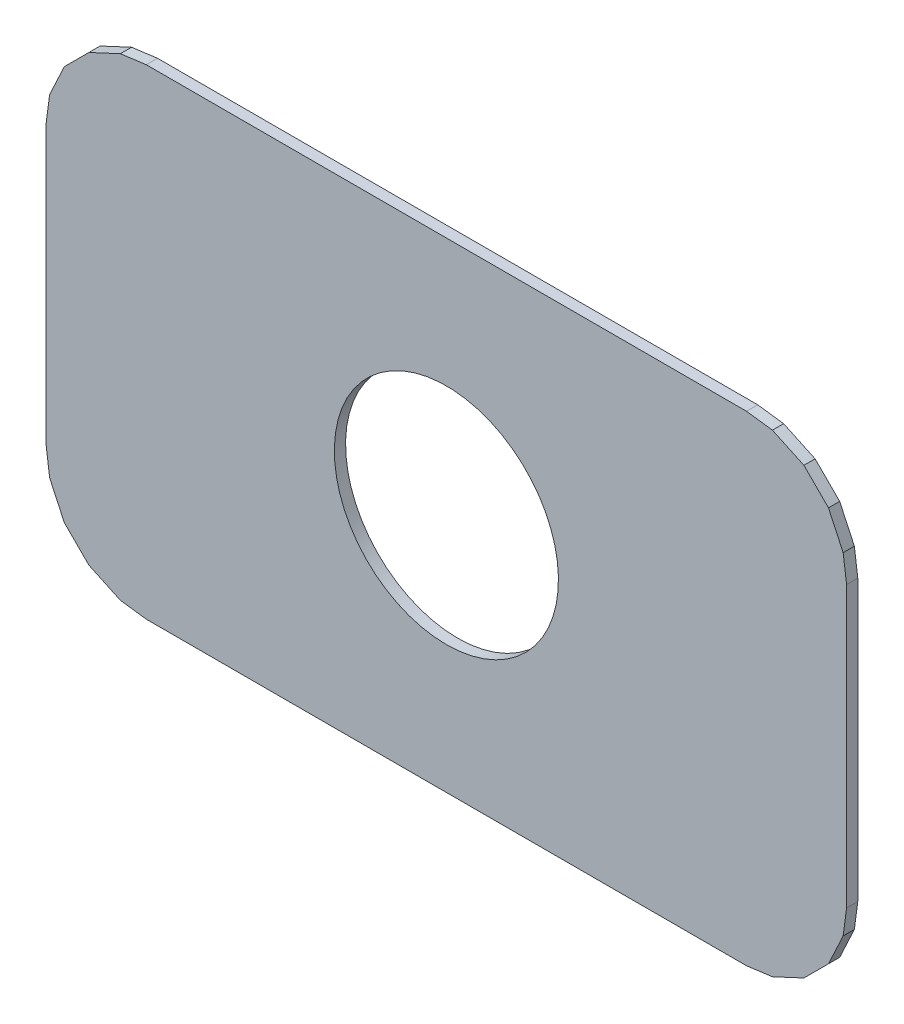
ISO-10303-21;
HEADER;
FILE_DESCRIPTION(('STEP AP214'),'2;1');
FILE_NAME('part.step','',(''),(''),'','','');
FILE_SCHEMA(('AUTOMOTIVE_DESIGN { 1 0 10303 214 1 1 1 1 }'));
ENDSEC;
DATA;
#1=APPLICATION_CONTEXT('core data for automotive mechanical design processes');
#2=APPLICATION_PROTOCOL_DEFINITION('international standard','automotive_design',2000,#1);
#3=PRODUCT_CONTEXT('',#1,'mechanical');
#4=PRODUCT('Part','Part','',(#3));
#5=PRODUCT_RELATED_PRODUCT_CATEGORY('part','',(#4));
#6=PRODUCT_DEFINITION_FORMATION('','',#4);
#7=PRODUCT_DEFINITION_CONTEXT('part definition',#1,'design');
#8=PRODUCT_DEFINITION('design','',#6,#7);
#9=PRODUCT_DEFINITION_SHAPE('','',#8);
#10=(LENGTH_UNIT() NAMED_UNIT(*) SI_UNIT(.MILLI.,.METRE.));
#11=(NAMED_UNIT(*) PLANE_ANGLE_UNIT() SI_UNIT($,.RADIAN.));
#12=(NAMED_UNIT(*) SI_UNIT($,.STERADIAN.) SOLID_ANGLE_UNIT());
#13=UNCERTAINTY_MEASURE_WITH_UNIT(LENGTH_MEASURE(1.E-05),#10,'distance_accuracy_value','');
#14=(GEOMETRIC_REPRESENTATION_CONTEXT(3) GLOBAL_UNCERTAINTY_ASSIGNED_CONTEXT((#13)) GLOBAL_UNIT_ASSIGNED_CONTEXT((#10,
#11,#12)) REPRESENTATION_CONTEXT('',''));
#15=CARTESIAN_POINT('',(0.,0.,0.));
#16=DIRECTION('',(0.,0.,1.));
#17=DIRECTION('',(1.,0.,0.));
#18=AXIS2_PLACEMENT_3D('',#15,#16,#17);
#19=CARTESIAN_POINT('',(115.401,-115.808,-0.045));
#20=DIRECTION('',(0.,0.,-1.));
#21=DIRECTION('',(0.,-1.,0.));
#22=AXIS2_PLACEMENT_3D('',#19,#20,#21);
#23=CYLINDRICAL_SURFACE('',#22,0.35);
#24=CARTESIAN_POINT('',(115.401,-115.808,-0.035));
#25=DIRECTION('',(0.,0.,-1.));
#26=DIRECTION('',(0.,-1.,0.));
#27=AXIS2_PLACEMENT_3D('',#24,#25,#26);
#28=CIRCLE('',#27,0.35);
#29=CARTESIAN_POINT('',(115.401,-116.158,-0.035));
#30=VERTEX_POINT('',#29);
#31=EDGE_CURVE('E370',#30,#30,#28,.T.);
#32=ORIENTED_EDGE('',*,*,#31,.T.);
#33=DIRECTION('',(0.,0.,1.));
#34=VECTOR('',#33,1.);
#35=CARTESIAN_POINT('',(115.401,-116.158,-0.045));
#36=LINE('',#35,#34);
#37=CARTESIAN_POINT('',(115.401,-116.158,0.));
#38=VERTEX_POINT('',#37);
#39=EDGE_CURVE('E11',#30,#38,#36,.T.);
#40=ORIENTED_EDGE('',*,*,#39,.T.);
#41=CARTESIAN_POINT('',(115.401,-115.808,0.));
#42=DIRECTION('',(0.,0.,-1.));
#43=DIRECTION('',(0.,-1.,0.));
#44=AXIS2_PLACEMENT_3D('',#41,#42,#43);
#45=CIRCLE('',#44,0.35);
#46=EDGE_CURVE('E432',#38,#38,#45,.T.);
#47=ORIENTED_EDGE('',*,*,#46,.F.);
#48=ORIENTED_EDGE('',*,*,#39,.F.);
#49=EDGE_LOOP('',(#32,#40,#47,#48));
#50=FACE_BOUND('',#49,.T.);
#51=ADVANCED_FACE('F17',(#50),#23,.F.);
#52=CARTESIAN_POINT('',(114.382619,-116.547352,-0.035));
#53=DIRECTION('',(-0.422618610856986,-0.90630762424097,0.));
#54=DIRECTION('',(-0.90630762424097,0.422618610856986,0.));
#55=AXIS2_PLACEMENT_3D('',#52,#53,#54);
#56=PLANE('',#55);
#57=DIRECTION('',(0.,0.,1.));
#58=VECTOR('',#57,1.);
#59=CARTESIAN_POINT('',(114.382619,-116.547352,-0.035));
#60=LINE('',#59,#58);
#61=CARTESIAN_POINT('',(114.382619,-116.547352,-0.035));
#62=VERTEX_POINT('',#61);
#63=CARTESIAN_POINT('',(114.382619,-116.547352,0.));
#64=VERTEX_POINT('',#63);
#65=EDGE_CURVE('E25',#62,#64,#60,.T.);
#66=ORIENTED_EDGE('',*,*,#65,.T.);
#67=DIRECTION('',(-0.90630762424097,0.422618610856986,0.));
#68=VECTOR('',#67,1.);
#69=CARTESIAN_POINT('',(114.382619,-116.547352,0.));
#70=LINE('',#69,#68);
#71=CARTESIAN_POINT('',(114.284257,-116.501485,0.));
#72=VERTEX_POINT('',#71);
#73=EDGE_CURVE('E414',#64,#72,#70,.T.);
#74=ORIENTED_EDGE('',*,*,#73,.T.);
#75=DIRECTION('',(0.,0.,1.));
#76=VECTOR('',#75,1.);
#77=CARTESIAN_POINT('',(114.284257,-116.501485,-0.035));
#78=LINE('',#77,#76);
#79=CARTESIAN_POINT('',(114.284257,-116.501485,-0.035));
#80=VERTEX_POINT('',#79);
#81=EDGE_CURVE('E278',#80,#72,#78,.T.);
#82=ORIENTED_EDGE('',*,*,#81,.F.);
#83=DIRECTION('',(-0.90630762424097,0.422618610856986,0.));
#84=VECTOR('',#83,1.);
#85=CARTESIAN_POINT('',(114.382619,-116.547352,-0.035));
#86=LINE('',#85,#84);
#87=EDGE_CURVE('E308',#62,#80,#86,.T.);
#88=ORIENTED_EDGE('',*,*,#87,.F.);
#89=EDGE_LOOP('',(#66,#74,#82,#88));
#90=FACE_BOUND('',#89,.T.);
#91=ADVANCED_FACE('F462',(#90),#56,.T.);
#92=CARTESIAN_POINT('',(114.4635,-116.558,-0.035));
#93=DIRECTION('',(-0.130523955190962,-0.99144515588171,0.));
#94=DIRECTION('',(-0.99144515588171,0.130523955190962,0.));
#95=AXIS2_PLACEMENT_3D('',#92,#93,#94);
#96=PLANE('',#95);
#97=DIRECTION('',(0.,0.,1.));
#98=VECTOR('',#97,1.);
#99=CARTESIAN_POINT('',(114.4635,-116.558,-0.035));
#100=LINE('',#99,#98);
#101=CARTESIAN_POINT('',(114.4635,-116.558,-0.035));
#102=VERTEX_POINT('',#101);
#103=CARTESIAN_POINT('',(114.4635,-116.558,0.));
#104=VERTEX_POINT('',#103);
#105=EDGE_CURVE('E275',#102,#104,#100,.T.);
#106=ORIENTED_EDGE('',*,*,#105,.T.);
#107=DIRECTION('',(-0.99144515588171,0.130523955190962,0.));
#108=VECTOR('',#107,1.);
#109=CARTESIAN_POINT('',(114.4635,-116.558,0.));
#110=LINE('',#109,#108);
#111=EDGE_CURVE('E418',#104,#64,#110,.T.);
#112=ORIENTED_EDGE('',*,*,#111,.T.);
#113=ORIENTED_EDGE('',*,*,#65,.F.);
#114=DIRECTION('',(-0.99144515588171,0.130523955190962,0.));
#115=VECTOR('',#114,1.);
#116=CARTESIAN_POINT('',(114.4635,-116.558,-0.035));
#117=LINE('',#116,#115);
#118=EDGE_CURVE('E304',#102,#62,#117,.T.);
#119=ORIENTED_EDGE('',*,*,#118,.F.);
#120=EDGE_LOOP('',(#106,#112,#113,#119));
#121=FACE_BOUND('',#120,.T.);
#122=ADVANCED_FACE('F477',(#121),#96,.T.);
#123=CARTESIAN_POINT('',(114.284257,-116.501485,-0.035));
#124=DIRECTION('',(-0.707106781186548,-0.707106781186548,0.));
#125=DIRECTION('',(-0.707106781186548,0.707106781186548,0.));
#126=AXIS2_PLACEMENT_3D('',#123,#124,#125);
#127=PLANE('',#126);
#128=ORIENTED_EDGE('',*,*,#81,.T.);
#129=DIRECTION('',(-0.707106781186548,0.707106781186548,0.));
#130=VECTOR('',#129,1.);
#131=CARTESIAN_POINT('',(114.284257,-116.501485,0.));
#132=LINE('',#131,#130);
#133=CARTESIAN_POINT('',(114.207515,-116.424743,0.));
#134=VERTEX_POINT('',#133);
#135=EDGE_CURVE('E410',#72,#134,#132,.T.);
#136=ORIENTED_EDGE('',*,*,#135,.T.);
#137=DIRECTION('',(0.,0.,1.));
#138=VECTOR('',#137,1.);
#139=CARTESIAN_POINT('',(114.207515,-116.424743,-0.035));
#140=LINE('',#139,#138);
#141=CARTESIAN_POINT('',(114.207515,-116.424743,-0.035));
#142=VERTEX_POINT('',#141);
#143=EDGE_CURVE('E279',#142,#134,#140,.T.);
#144=ORIENTED_EDGE('',*,*,#143,.F.);
#145=DIRECTION('',(-0.707106781186548,0.707106781186548,0.));
#146=VECTOR('',#145,1.);
#147=CARTESIAN_POINT('',(114.284257,-116.501485,-0.035));
#148=LINE('',#147,#146);
#149=EDGE_CURVE('E320',#80,#142,#148,.T.);
#150=ORIENTED_EDGE('',*,*,#149,.F.);
#151=EDGE_LOOP('',(#128,#136,#144,#150));
#152=FACE_BOUND('',#151,.T.);
#153=ADVANCED_FACE('F456',(#152),#127,.T.);
#154=CARTESIAN_POINT('',(116.3385,-116.558,-0.035));
#155=DIRECTION('',(0.,-1.,0.));
#156=DIRECTION('',(0.,0.,-1.));
#157=AXIS2_PLACEMENT_3D('',#154,#155,#156);
#158=PLANE('',#157);
#159=DIRECTION('',(0.,0.,1.));
#160=VECTOR('',#159,1.);
#161=CARTESIAN_POINT('',(116.3385,-116.558,-0.035));
#162=LINE('',#161,#160);
#163=CARTESIAN_POINT('',(116.3385,-116.558,-0.035));
#164=VERTEX_POINT('',#163);
#165=CARTESIAN_POINT('',(116.3385,-116.558,0.));
#166=VERTEX_POINT('',#165);
#167=EDGE_CURVE('E323',#164,#166,#162,.T.);
#168=ORIENTED_EDGE('',*,*,#167,.T.);
#169=DIRECTION('',(-1.,0.,0.));
#170=VECTOR('',#169,1.);
#171=CARTESIAN_POINT('',(116.3385,-116.558,0.));
#172=LINE('',#171,#170);
#173=EDGE_CURVE('E339',#166,#104,#172,.T.);
#174=ORIENTED_EDGE('',*,*,#173,.T.);
#175=ORIENTED_EDGE('',*,*,#105,.F.);
#176=DIRECTION('',(-1.,0.,0.));
#177=VECTOR('',#176,1.);
#178=CARTESIAN_POINT('',(116.3385,-116.558,-0.035));
#179=LINE('',#178,#177);
#180=EDGE_CURVE('E303',#164,#102,#179,.T.);
#181=ORIENTED_EDGE('',*,*,#180,.F.);
#182=EDGE_LOOP('',(#168,#174,#175,#181));
#183=FACE_BOUND('',#182,.T.);
#184=ADVANCED_FACE('F550',(#183),#158,.T.);
#185=CARTESIAN_POINT('',(114.207515,-116.424743,-0.035));
#186=DIRECTION('',(-0.90630762424097,-0.422618610856986,0.));
#187=DIRECTION('',(-0.422618610856986,0.90630762424097,0.));
#188=AXIS2_PLACEMENT_3D('',#185,#186,#187);
#189=PLANE('',#188);
#190=ORIENTED_EDGE('',*,*,#143,.T.);
#191=DIRECTION('',(-0.422618610856986,0.90630762424097,0.));
#192=VECTOR('',#191,1.);
#193=CARTESIAN_POINT('',(114.207515,-116.424743,0.));
#194=LINE('',#193,#192);
#195=CARTESIAN_POINT('',(114.161648,-116.326381,0.));
#196=VERTEX_POINT('',#195);
#197=EDGE_CURVE('E404',#134,#196,#194,.T.);
#198=ORIENTED_EDGE('',*,*,#197,.T.);
#199=DIRECTION('',(0.,0.,1.));
#200=VECTOR('',#199,1.);
#201=CARTESIAN_POINT('',(114.161648,-116.326381,-0.035));
#202=LINE('',#201,#200);
#203=CARTESIAN_POINT('',(114.161648,-116.326381,-0.035));
#204=VERTEX_POINT('',#203);
#205=EDGE_CURVE('E383',#204,#196,#202,.T.);
#206=ORIENTED_EDGE('',*,*,#205,.F.);
#207=DIRECTION('',(-0.422618610856986,0.90630762424097,0.));
#208=VECTOR('',#207,1.);
#209=CARTESIAN_POINT('',(114.207515,-116.424743,-0.035));
#210=LINE('',#209,#208);
#211=EDGE_CURVE('E327',#142,#204,#210,.T.);
#212=ORIENTED_EDGE('',*,*,#211,.F.);
#213=EDGE_LOOP('',(#190,#198,#206,#212));
#214=FACE_BOUND('',#213,.T.);
#215=ADVANCED_FACE('F470',(#214),#189,.T.);
#216=CARTESIAN_POINT('',(116.419381,-116.547352,-0.035));
#217=DIRECTION('',(0.130523955190962,-0.99144515588171,0.));
#218=DIRECTION('',(0.,0.,-1.));
#219=AXIS2_PLACEMENT_3D('',#216,#217,#218);
#220=PLANE('',#219);
#221=DIRECTION('',(0.,0.,1.));
#222=VECTOR('',#221,1.);
#223=CARTESIAN_POINT('',(116.419381,-116.547352,-0.035));
#224=LINE('',#223,#222);
#225=CARTESIAN_POINT('',(116.419381,-116.547352,-0.035));
#226=VERTEX_POINT('',#225);
#227=CARTESIAN_POINT('',(116.419381,-116.547352,0.));
#228=VERTEX_POINT('',#227);
#229=EDGE_CURVE('E450',#226,#228,#224,.T.);
#230=ORIENTED_EDGE('',*,*,#229,.T.);
#231=DIRECTION('',(-0.99144515588171,-0.130523955190962,0.));
#232=VECTOR('',#231,1.);
#233=CARTESIAN_POINT('',(116.419381,-116.547352,0.));
#234=LINE('',#233,#232);
#235=EDGE_CURVE('E334',#228,#166,#234,.T.);
#236=ORIENTED_EDGE('',*,*,#235,.T.);
#237=ORIENTED_EDGE('',*,*,#167,.F.);
#238=DIRECTION('',(-0.99144515588171,-0.130523955190962,0.));
#239=VECTOR('',#238,1.);
#240=CARTESIAN_POINT('',(116.419381,-116.547352,-0.035));
#241=LINE('',#240,#239);
#242=EDGE_CURVE('E298',#226,#164,#241,.T.);
#243=ORIENTED_EDGE('',*,*,#242,.F.);
#244=EDGE_LOOP('',(#230,#236,#237,#243));
#245=FACE_BOUND('',#244,.T.);
#246=ADVANCED_FACE('F549',(#245),#220,.T.);
#247=CARTESIAN_POINT('',(114.161648,-116.326381,-0.035));
#248=DIRECTION('',(-0.99144515588171,-0.130523955190962,0.));
#249=DIRECTION('',(-0.130523955190962,0.99144515588171,0.));
#250=AXIS2_PLACEMENT_3D('',#247,#248,#249);
#251=PLANE('',#250);
#252=ORIENTED_EDGE('',*,*,#205,.T.);
#253=DIRECTION('',(-0.130523955190962,0.99144515588171,0.));
#254=VECTOR('',#253,1.);
#255=CARTESIAN_POINT('',(114.161648,-116.326381,0.));
#256=LINE('',#255,#254);
#257=CARTESIAN_POINT('',(114.151,-116.2455,0.));
#258=VERTEX_POINT('',#257);
#259=EDGE_CURVE('E400',#196,#258,#256,.T.);
#260=ORIENTED_EDGE('',*,*,#259,.T.);
#261=DIRECTION('',(0.,0.,1.));
#262=VECTOR('',#261,1.);
#263=CARTESIAN_POINT('',(114.151,-116.2455,-0.035));
#264=LINE('',#263,#262);
#265=CARTESIAN_POINT('',(114.151,-116.2455,-0.035));
#266=VERTEX_POINT('',#265);
#267=EDGE_CURVE('E448',#266,#258,#264,.T.);
#268=ORIENTED_EDGE('',*,*,#267,.F.);
#269=DIRECTION('',(-0.130523955190962,0.99144515588171,0.));
#270=VECTOR('',#269,1.);
#271=CARTESIAN_POINT('',(114.161648,-116.326381,-0.035));
#272=LINE('',#271,#270);
#273=EDGE_CURVE('E331',#204,#266,#272,.T.);
#274=ORIENTED_EDGE('',*,*,#273,.F.);
#275=EDGE_LOOP('',(#252,#260,#268,#274));
#276=FACE_BOUND('',#275,.T.);
#277=ADVANCED_FACE('F657',(#276),#251,.T.);
#278=CARTESIAN_POINT('',(116.517743,-116.501485,-0.035));
#279=DIRECTION('',(0.422618610856986,-0.90630762424097,0.));
#280=DIRECTION('',(0.,0.,-1.));
#281=AXIS2_PLACEMENT_3D('',#278,#279,#280);
#282=PLANE('',#281);
#283=DIRECTION('',(0.,0.,1.));
#284=VECTOR('',#283,1.);
#285=CARTESIAN_POINT('',(116.517743,-116.501485,-0.035));
#286=LINE('',#285,#284);
#287=CARTESIAN_POINT('',(116.517743,-116.501485,-0.035));
#288=VERTEX_POINT('',#287);
#289=CARTESIAN_POINT('',(116.517743,-116.501485,0.));
#290=VERTEX_POINT('',#289);
#291=EDGE_CURVE('E447',#288,#290,#286,.T.);
#292=ORIENTED_EDGE('',*,*,#291,.T.);
#293=DIRECTION('',(-0.90630762424097,-0.422618610856986,0.));
#294=VECTOR('',#293,1.);
#295=CARTESIAN_POINT('',(116.517743,-116.501485,0.));
#296=LINE('',#295,#294);
#297=EDGE_CURVE('E338',#290,#228,#296,.T.);
#298=ORIENTED_EDGE('',*,*,#297,.T.);
#299=ORIENTED_EDGE('',*,*,#229,.F.);
#300=DIRECTION('',(-0.90630762424097,-0.422618610856986,0.));
#301=VECTOR('',#300,1.);
#302=CARTESIAN_POINT('',(116.517743,-116.501485,-0.035));
#303=LINE('',#302,#301);
#304=EDGE_CURVE('E294',#288,#226,#303,.T.);
#305=ORIENTED_EDGE('',*,*,#304,.F.);
#306=EDGE_LOOP('',(#292,#298,#299,#305));
#307=FACE_BOUND('',#306,.T.);
#308=ADVANCED_FACE('F546',(#307),#282,.T.);
#309=CARTESIAN_POINT('',(114.151,-116.2455,-0.035));
#310=DIRECTION('',(-1.,0.,0.));
#311=DIRECTION('',(0.,0.,1.));
#312=AXIS2_PLACEMENT_3D('',#309,#310,#311);
#313=PLANE('',#312);
#314=ORIENTED_EDGE('',*,*,#267,.T.);
#315=DIRECTION('',(0.,1.,0.));
#316=VECTOR('',#315,1.);
#317=CARTESIAN_POINT('',(114.151,-116.2455,0.));
#318=LINE('',#317,#316);
#319=CARTESIAN_POINT('',(114.151,-115.3705,0.));
#320=VERTEX_POINT('',#319);
#321=EDGE_CURVE('E396',#258,#320,#318,.T.);
#322=ORIENTED_EDGE('',*,*,#321,.T.);
#323=DIRECTION('',(0.,0.,1.));
#324=VECTOR('',#323,1.);
#325=CARTESIAN_POINT('',(114.151,-115.3705,-0.035));
#326=LINE('',#325,#324);
#327=CARTESIAN_POINT('',(114.151,-115.3705,-0.035));
#328=VERTEX_POINT('',#327);
#329=EDGE_CURVE('E444',#328,#320,#326,.T.);
#330=ORIENTED_EDGE('',*,*,#329,.F.);
#331=DIRECTION('',(0.,1.,0.));
#332=VECTOR('',#331,1.);
#333=CARTESIAN_POINT('',(114.151,-116.2455,-0.035));
#334=LINE('',#333,#332);
#335=EDGE_CURVE('E343',#266,#328,#334,.T.);
#336=ORIENTED_EDGE('',*,*,#335,.F.);
#337=EDGE_LOOP('',(#314,#322,#330,#336));
#338=FACE_BOUND('',#337,.T.);
#339=ADVANCED_FACE('F649',(#338),#313,.T.);
#340=CARTESIAN_POINT('',(116.594485,-116.424743,-0.035));
#341=DIRECTION('',(0.707106781186048,-0.707106781187048,0.));
#342=DIRECTION('',(0.,0.,-1.));
#343=AXIS2_PLACEMENT_3D('',#340,#341,#342);
#344=PLANE('',#343);
#345=DIRECTION('',(0.,0.,1.));
#346=VECTOR('',#345,1.);
#347=CARTESIAN_POINT('',(116.594485,-116.424743,-0.035));
#348=LINE('',#347,#346);
#349=CARTESIAN_POINT('',(116.594485,-116.424743,-0.035));
#350=VERTEX_POINT('',#349);
#351=CARTESIAN_POINT('',(116.594485,-116.424743,0.));
#352=VERTEX_POINT('',#351);
#353=EDGE_CURVE('E441',#350,#352,#348,.T.);
#354=ORIENTED_EDGE('',*,*,#353,.T.);
#355=DIRECTION('',(-0.707106781187048,-0.707106781186048,0.));
#356=VECTOR('',#355,1.);
#357=CARTESIAN_POINT('',(116.594485,-116.424743,0.));
#358=LINE('',#357,#356);
#359=EDGE_CURVE('E284',#352,#290,#358,.T.);
#360=ORIENTED_EDGE('',*,*,#359,.T.);
#361=ORIENTED_EDGE('',*,*,#291,.F.);
#362=DIRECTION('',(-0.707106781187048,-0.707106781186048,0.));
#363=VECTOR('',#362,1.);
#364=CARTESIAN_POINT('',(116.594485,-116.424743,-0.035));
#365=LINE('',#364,#363);
#366=EDGE_CURVE('E299',#350,#288,#365,.T.);
#367=ORIENTED_EDGE('',*,*,#366,.F.);
#368=EDGE_LOOP('',(#354,#360,#361,#367));
#369=FACE_BOUND('',#368,.T.);
#370=ADVANCED_FACE('F543',(#369),#344,.T.);
#371=CARTESIAN_POINT('',(114.151,-115.3705,-0.035));
#372=DIRECTION('',(-0.99144515588171,0.130523955190962,0.));
#373=DIRECTION('',(0.,0.,1.));
#374=AXIS2_PLACEMENT_3D('',#371,#372,#373);
#375=PLANE('',#374);
#376=ORIENTED_EDGE('',*,*,#329,.T.);
#377=DIRECTION('',(0.130523955190962,0.99144515588171,0.));
#378=VECTOR('',#377,1.);
#379=CARTESIAN_POINT('',(114.151,-115.3705,0.));
#380=LINE('',#379,#378);
#381=CARTESIAN_POINT('',(114.161648,-115.289619,0.));
#382=VERTEX_POINT('',#381);
#383=EDGE_CURVE('E392',#320,#382,#380,.T.);
#384=ORIENTED_EDGE('',*,*,#383,.T.);
#385=DIRECTION('',(0.,0.,1.));
#386=VECTOR('',#385,1.);
#387=CARTESIAN_POINT('',(114.161648,-115.289619,-0.035));
#388=LINE('',#387,#386);
#389=CARTESIAN_POINT('',(114.161648,-115.289619,-0.035));
#390=VERTEX_POINT('',#389);
#391=EDGE_CURVE('E312',#390,#382,#388,.T.);
#392=ORIENTED_EDGE('',*,*,#391,.F.);
#393=DIRECTION('',(0.130523955190962,0.99144515588171,0.));
#394=VECTOR('',#393,1.);
#395=CARTESIAN_POINT('',(114.151,-115.3705,-0.035));
#396=LINE('',#395,#394);
#397=EDGE_CURVE('E347',#328,#390,#396,.T.);
#398=ORIENTED_EDGE('',*,*,#397,.F.);
#399=EDGE_LOOP('',(#376,#384,#392,#398));
#400=FACE_BOUND('',#399,.T.);
#401=ADVANCED_FACE('F638',(#400),#375,.T.);
#402=CARTESIAN_POINT('',(116.640352,-116.326381,-0.035));
#403=DIRECTION('',(0.906307624241353,-0.422618610856164,0.));
#404=DIRECTION('',(0.,0.,-1.));
#405=AXIS2_PLACEMENT_3D('',#402,#403,#404);
#406=PLANE('',#405);
#407=DIRECTION('',(0.,0.,1.));
#408=VECTOR('',#407,1.);
#409=CARTESIAN_POINT('',(116.640352,-116.326381,-0.035));
#410=LINE('',#409,#408);
#411=CARTESIAN_POINT('',(116.640352,-116.326381,-0.035));
#412=VERTEX_POINT('',#411);
#413=CARTESIAN_POINT('',(116.640352,-116.326381,0.));
#414=VERTEX_POINT('',#413);
#415=EDGE_CURVE('E309',#412,#414,#410,.T.);
#416=ORIENTED_EDGE('',*,*,#415,.T.);
#417=DIRECTION('',(-0.422618610856164,-0.906307624241353,0.));
#418=VECTOR('',#417,1.);
#419=CARTESIAN_POINT('',(116.640352,-116.326381,0.));
#420=LINE('',#419,#418);
#421=EDGE_CURVE('E280',#414,#352,#420,.T.);
#422=ORIENTED_EDGE('',*,*,#421,.T.);
#423=ORIENTED_EDGE('',*,*,#353,.F.);
#424=DIRECTION('',(-0.422618610856164,-0.906307624241353,0.));
#425=VECTOR('',#424,1.);
#426=CARTESIAN_POINT('',(116.640352,-116.326381,-0.035));
#427=LINE('',#426,#425);
#428=EDGE_CURVE('E489',#412,#350,#427,.T.);
#429=ORIENTED_EDGE('',*,*,#428,.F.);
#430=EDGE_LOOP('',(#416,#422,#423,#429));
#431=FACE_BOUND('',#430,.T.);
#432=ADVANCED_FACE('F539',(#431),#406,.T.);
#433=CARTESIAN_POINT('',(114.161648,-115.289619,-0.035));
#434=DIRECTION('',(-0.90630762424097,0.422618610856986,0.));
#435=DIRECTION('',(0.,0.,1.));
#436=AXIS2_PLACEMENT_3D('',#433,#434,#435);
#437=PLANE('',#436);
#438=ORIENTED_EDGE('',*,*,#391,.T.);
#439=DIRECTION('',(0.422618610856986,0.90630762424097,0.));
#440=VECTOR('',#439,1.);
#441=CARTESIAN_POINT('',(114.161648,-115.289619,0.));
#442=LINE('',#441,#440);
#443=CARTESIAN_POINT('',(114.207515,-115.191257,0.));
#444=VERTEX_POINT('',#443);
#445=EDGE_CURVE('E388',#382,#444,#442,.T.);
#446=ORIENTED_EDGE('',*,*,#445,.T.);
#447=DIRECTION('',(0.,0.,1.));
#448=VECTOR('',#447,1.);
#449=CARTESIAN_POINT('',(114.207515,-115.191257,-0.035));
#450=LINE('',#449,#448);
#451=CARTESIAN_POINT('',(114.207515,-115.191257,-0.035));
#452=VERTEX_POINT('',#451);
#453=EDGE_CURVE('E313',#452,#444,#450,.T.);
#454=ORIENTED_EDGE('',*,*,#453,.F.);
#455=DIRECTION('',(0.422618610856986,0.90630762424097,0.));
#456=VECTOR('',#455,1.);
#457=CARTESIAN_POINT('',(114.161648,-115.289619,-0.035));
#458=LINE('',#457,#456);
#459=EDGE_CURVE('E355',#390,#452,#458,.T.);
#460=ORIENTED_EDGE('',*,*,#459,.F.);
#461=EDGE_LOOP('',(#438,#446,#454,#460));
#462=FACE_BOUND('',#461,.T.);
#463=ADVANCED_FACE('F597',(#462),#437,.T.);
#464=CARTESIAN_POINT('',(116.651,-116.2455,-0.035));
#465=DIRECTION('',(0.99144515588171,-0.130523955190962,0.));
#466=DIRECTION('',(0.,0.,-1.));
#467=AXIS2_PLACEMENT_3D('',#464,#465,#466);
#468=PLANE('',#467);
#469=DIRECTION('',(0.,0.,1.));
#470=VECTOR('',#469,1.);
#471=CARTESIAN_POINT('',(116.651,-116.2455,-0.035));
#472=LINE('',#471,#470);
#473=CARTESIAN_POINT('',(116.651,-116.2455,-0.035));
#474=VERTEX_POINT('',#473);
#475=CARTESIAN_POINT('',(116.651,-116.2455,0.));
#476=VERTEX_POINT('',#475);
#477=EDGE_CURVE('E255',#474,#476,#472,.T.);
#478=ORIENTED_EDGE('',*,*,#477,.T.);
#479=DIRECTION('',(-0.130523955190962,-0.99144515588171,0.));
#480=VECTOR('',#479,1.);
#481=CARTESIAN_POINT('',(116.651,-116.2455,0.));
#482=LINE('',#481,#480);
#483=EDGE_CURVE('E283',#476,#414,#482,.T.);
#484=ORIENTED_EDGE('',*,*,#483,.T.);
#485=ORIENTED_EDGE('',*,*,#415,.F.);
#486=DIRECTION('',(-0.130523955190962,-0.99144515588171,0.));
#487=VECTOR('',#486,1.);
#488=CARTESIAN_POINT('',(116.651,-116.2455,-0.035));
#489=LINE('',#488,#487);
#490=EDGE_CURVE('E260',#474,#412,#489,.T.);
#491=ORIENTED_EDGE('',*,*,#490,.F.);
#492=EDGE_LOOP('',(#478,#484,#485,#491));
#493=FACE_BOUND('',#492,.T.);
#494=ADVANCED_FACE('F594',(#493),#468,.T.);
#495=CARTESIAN_POINT('',(114.207515,-115.191257,-0.035));
#496=DIRECTION('',(-0.707106781186548,0.707106781186548,0.));
#497=DIRECTION('',(0.,0.,1.));
#498=AXIS2_PLACEMENT_3D('',#495,#496,#497);
#499=PLANE('',#498);
#500=ORIENTED_EDGE('',*,*,#453,.T.);
#501=DIRECTION('',(0.707106781186548,0.707106781186548,0.));
#502=VECTOR('',#501,1.);
#503=CARTESIAN_POINT('',(114.207515,-115.191257,0.));
#504=LINE('',#503,#502);
#505=CARTESIAN_POINT('',(114.284257,-115.114515,0.));
#506=VERTEX_POINT('',#505);
#507=EDGE_CURVE('E292',#444,#506,#504,.T.);
#508=ORIENTED_EDGE('',*,*,#507,.T.);
#509=DIRECTION('',(0.,0.,1.));
#510=VECTOR('',#509,1.);
#511=CARTESIAN_POINT('',(114.284257,-115.114515,-0.035));
#512=LINE('',#511,#510);
#513=CARTESIAN_POINT('',(114.284257,-115.114515,-0.035));
#514=VERTEX_POINT('',#513);
#515=EDGE_CURVE('E249',#514,#506,#512,.T.);
#516=ORIENTED_EDGE('',*,*,#515,.F.);
#517=DIRECTION('',(0.707106781186548,0.707106781186548,0.));
#518=VECTOR('',#517,1.);
#519=CARTESIAN_POINT('',(114.207515,-115.191257,-0.035));
#520=LINE('',#519,#518);
#521=EDGE_CURVE('E359',#452,#514,#520,.T.);
#522=ORIENTED_EDGE('',*,*,#521,.F.);
#523=EDGE_LOOP('',(#500,#508,#516,#522));
#524=FACE_BOUND('',#523,.T.);
#525=ADVANCED_FACE('F596',(#524),#499,.T.);
#526=CARTESIAN_POINT('',(116.651,-115.3705,-0.035));
#527=DIRECTION('',(1.,0.,0.));
#528=DIRECTION('',(0.,1.,0.));
#529=AXIS2_PLACEMENT_3D('',#526,#527,#528);
#530=PLANE('',#529);
#531=DIRECTION('',(0.,0.,1.));
#532=VECTOR('',#531,1.);
#533=CARTESIAN_POINT('',(116.651,-115.3705,-0.035));
#534=LINE('',#533,#532);
#535=CARTESIAN_POINT('',(116.651,-115.3705,-0.035));
#536=VERTEX_POINT('',#535);
#537=CARTESIAN_POINT('',(116.651,-115.3705,0.));
#538=VERTEX_POINT('',#537);
#539=EDGE_CURVE('E237',#536,#538,#534,.T.);
#540=ORIENTED_EDGE('',*,*,#539,.T.);
#541=DIRECTION('',(0.,-1.,0.));
#542=VECTOR('',#541,1.);
#543=CARTESIAN_POINT('',(116.651,-115.3705,0.));
#544=LINE('',#543,#542);
#545=EDGE_CURVE('E351',#538,#476,#544,.T.);
#546=ORIENTED_EDGE('',*,*,#545,.T.);
#547=ORIENTED_EDGE('',*,*,#477,.F.);
#548=DIRECTION('',(0.,-1.,0.));
#549=VECTOR('',#548,1.);
#550=CARTESIAN_POINT('',(116.651,-115.3705,-0.035));
#551=LINE('',#550,#549);
#552=EDGE_CURVE('E253',#536,#474,#551,.T.);
#553=ORIENTED_EDGE('',*,*,#552,.F.);
#554=EDGE_LOOP('',(#540,#546,#547,#553));
#555=FACE_BOUND('',#554,.T.);
#556=ADVANCED_FACE('F254',(#555),#530,.T.);
#557=CARTESIAN_POINT('',(114.284257,-115.114515,-0.035));
#558=DIRECTION('',(-0.422618610856986,0.90630762424097,0.));
#559=DIRECTION('',(0.,0.,1.));
#560=AXIS2_PLACEMENT_3D('',#557,#558,#559);
#561=PLANE('',#560);
#562=ORIENTED_EDGE('',*,*,#515,.T.);
#563=DIRECTION('',(0.90630762424097,0.422618610856986,0.));
#564=VECTOR('',#563,1.);
#565=CARTESIAN_POINT('',(114.284257,-115.114515,0.));
#566=LINE('',#565,#564);
#567=CARTESIAN_POINT('',(114.382619,-115.068648,0.));
#568=VERTEX_POINT('',#567);
#569=EDGE_CURVE('E288',#506,#568,#566,.T.);
#570=ORIENTED_EDGE('',*,*,#569,.T.);
#571=DIRECTION('',(0.,0.,1.));
#572=VECTOR('',#571,1.);
#573=CARTESIAN_POINT('',(114.382619,-115.068648,-0.035));
#574=LINE('',#573,#572);
#575=CARTESIAN_POINT('',(114.382619,-115.068648,-0.035));
#576=VERTEX_POINT('',#575);
#577=EDGE_CURVE('E250',#576,#568,#574,.T.);
#578=ORIENTED_EDGE('',*,*,#577,.F.);
#579=DIRECTION('',(0.90630762424097,0.422618610856986,0.));
#580=VECTOR('',#579,1.);
#581=CARTESIAN_POINT('',(114.284257,-115.114515,-0.035));
#582=LINE('',#581,#580);
#583=EDGE_CURVE('E360',#514,#576,#582,.T.);
#584=ORIENTED_EDGE('',*,*,#583,.F.);
#585=EDGE_LOOP('',(#562,#570,#578,#584));
#586=FACE_BOUND('',#585,.T.);
#587=ADVANCED_FACE('F631',(#586),#561,.T.);
#588=CARTESIAN_POINT('',(116.640352,-115.289619,-0.035));
#589=DIRECTION('',(0.99144515588171,0.130523955190962,0.));
#590=DIRECTION('',(0.,0.,-1.));
#591=AXIS2_PLACEMENT_3D('',#588,#589,#590);
#592=PLANE('',#591);
#593=DIRECTION('',(0.,0.,1.));
#594=VECTOR('',#593,1.);
#595=CARTESIAN_POINT('',(116.640352,-115.289619,-0.035));
#596=LINE('',#595,#594);
#597=CARTESIAN_POINT('',(116.640352,-115.289619,-0.035));
#598=VERTEX_POINT('',#597);
#599=CARTESIAN_POINT('',(116.640352,-115.289619,0.));
#600=VERTEX_POINT('',#599);
#601=EDGE_CURVE('E45',#598,#600,#596,.T.);
#602=ORIENTED_EDGE('',*,*,#601,.T.);
#603=DIRECTION('',(0.130523955190962,-0.99144515588171,0.));
#604=VECTOR('',#603,1.);
#605=CARTESIAN_POINT('',(116.640352,-115.289619,0.));
#606=LINE('',#605,#604);
#607=EDGE_CURVE('E244',#600,#538,#606,.T.);
#608=ORIENTED_EDGE('',*,*,#607,.T.);
#609=ORIENTED_EDGE('',*,*,#539,.F.);
#610=DIRECTION('',(0.130523955190962,-0.99144515588171,0.));
#611=VECTOR('',#610,1.);
#612=CARTESIAN_POINT('',(116.640352,-115.289619,-0.035));
#613=LINE('',#612,#611);
#614=EDGE_CURVE('E241',#598,#536,#613,.T.);
#615=ORIENTED_EDGE('',*,*,#614,.F.);
#616=EDGE_LOOP('',(#602,#608,#609,#615));
#617=FACE_BOUND('',#616,.T.);
#618=ADVANCED_FACE('F239',(#617),#592,.T.);
#619=CARTESIAN_POINT('',(114.382619,-115.068648,-0.035));
#620=DIRECTION('',(-0.130523955190962,0.99144515588171,0.));
#621=DIRECTION('',(0.,0.,1.));
#622=AXIS2_PLACEMENT_3D('',#619,#620,#621);
#623=PLANE('',#622);
#624=ORIENTED_EDGE('',*,*,#577,.T.);
#625=DIRECTION('',(0.99144515588171,0.130523955190962,0.));
#626=VECTOR('',#625,1.);
#627=CARTESIAN_POINT('',(114.382619,-115.068648,0.));
#628=LINE('',#627,#626);
#629=CARTESIAN_POINT('',(114.4635,-115.058,0.));
#630=VERTEX_POINT('',#629);
#631=EDGE_CURVE('E293',#568,#630,#628,.T.);
#632=ORIENTED_EDGE('',*,*,#631,.T.);
#633=DIRECTION('',(0.,0.,1.));
#634=VECTOR('',#633,1.);
#635=CARTESIAN_POINT('',(114.4635,-115.058,-0.035));
#636=LINE('',#635,#634);
#637=CARTESIAN_POINT('',(114.4635,-115.058,-0.035));
#638=VERTEX_POINT('',#637);
#639=EDGE_CURVE('E316',#638,#630,#636,.T.);
#640=ORIENTED_EDGE('',*,*,#639,.F.);
#641=DIRECTION('',(0.99144515588171,0.130523955190962,0.));
#642=VECTOR('',#641,1.);
#643=CARTESIAN_POINT('',(114.382619,-115.068648,-0.035));
#644=LINE('',#643,#642);
#645=EDGE_CURVE('E364',#576,#638,#644,.T.);
#646=ORIENTED_EDGE('',*,*,#645,.F.);
#647=EDGE_LOOP('',(#624,#632,#640,#646));
#648=FACE_BOUND('',#647,.T.);
#649=ADVANCED_FACE('F573',(#648),#623,.T.);
#650=CARTESIAN_POINT('',(116.594485,-115.191257,-0.035));
#651=DIRECTION('',(0.906307624241353,0.422618610856164,0.));
#652=DIRECTION('',(0.,0.,-1.));
#653=AXIS2_PLACEMENT_3D('',#650,#651,#652);
#654=PLANE('',#653);
#655=DIRECTION('',(0.,0.,1.));
#656=VECTOR('',#655,1.);
#657=CARTESIAN_POINT('',(116.594485,-115.191257,-0.035));
#658=LINE('',#657,#656);
#659=CARTESIAN_POINT('',(116.594485,-115.191257,-0.035));
#660=VERTEX_POINT('',#659);
#661=CARTESIAN_POINT('',(116.594485,-115.191257,0.));
#662=VERTEX_POINT('',#661);
#663=EDGE_CURVE('E506',#660,#662,#658,.T.);
#664=ORIENTED_EDGE('',*,*,#663,.T.);
#665=DIRECTION('',(0.422618610856164,-0.906307624241353,0.));
#666=VECTOR('',#665,1.);
#667=CARTESIAN_POINT('',(116.594485,-115.191257,0.));
#668=LINE('',#667,#666);
#669=EDGE_CURVE('E429',#662,#600,#668,.T.);
#670=ORIENTED_EDGE('',*,*,#669,.T.);
#671=ORIENTED_EDGE('',*,*,#601,.F.);
#672=DIRECTION('',(0.422618610856164,-0.906307624241353,0.));
#673=VECTOR('',#672,1.);
#674=CARTESIAN_POINT('',(116.594485,-115.191257,-0.035));
#675=LINE('',#674,#673);
#676=EDGE_CURVE('E264',#660,#598,#675,.T.);
#677=ORIENTED_EDGE('',*,*,#676,.F.);
#678=EDGE_LOOP('',(#664,#670,#671,#677));
#679=FACE_BOUND('',#678,.T.);
#680=ADVANCED_FACE('F591',(#679),#654,.T.);
#681=CARTESIAN_POINT('',(114.4635,-115.058,-0.035));
#682=DIRECTION('',(0.,1.,0.));
#683=DIRECTION('',(1.,0.,0.));
#684=AXIS2_PLACEMENT_3D('',#681,#682,#683);
#685=PLANE('',#684);
#686=ORIENTED_EDGE('',*,*,#639,.T.);
#687=DIRECTION('',(1.,0.,0.));
#688=VECTOR('',#687,1.);
#689=CARTESIAN_POINT('',(114.4635,-115.058,0.));
#690=LINE('',#689,#688);
#691=CARTESIAN_POINT('',(116.3385,-115.058,0.));
#692=VERTEX_POINT('',#691);
#693=EDGE_CURVE('E373',#630,#692,#690,.T.);
#694=ORIENTED_EDGE('',*,*,#693,.T.);
#695=DIRECTION('',(0.,0.,1.));
#696=VECTOR('',#695,1.);
#697=CARTESIAN_POINT('',(116.3385,-115.058,-0.035));
#698=LINE('',#697,#696);
#699=CARTESIAN_POINT('',(116.3385,-115.058,-0.035));
#700=VERTEX_POINT('',#699);
#701=EDGE_CURVE('E511',#700,#692,#698,.T.);
#702=ORIENTED_EDGE('',*,*,#701,.F.);
#703=DIRECTION('',(1.,0.,0.));
#704=VECTOR('',#703,1.);
#705=CARTESIAN_POINT('',(114.4635,-115.058,-0.035));
#706=LINE('',#705,#704);
#707=EDGE_CURVE('E367',#638,#700,#706,.T.);
#708=ORIENTED_EDGE('',*,*,#707,.F.);
#709=EDGE_LOOP('',(#686,#694,#702,#708));
#710=FACE_BOUND('',#709,.T.);
#711=ADVANCED_FACE('F578',(#710),#685,.T.);
#712=CARTESIAN_POINT('',(0.,0.,0.));
#713=DIRECTION('',(0.,0.,1.));
#714=DIRECTION('',(1.,0.,0.));
#715=AXIS2_PLACEMENT_3D('',#712,#713,#714);
#716=PLANE('',#715);
#717=ORIENTED_EDGE('',*,*,#46,.T.);
#718=EDGE_LOOP('',(#717));
#719=FACE_BOUND('',#718,.T.);
#720=DIRECTION('',(0.90630762424097,-0.422618610856986,0.));
#721=VECTOR('',#720,1.);
#722=CARTESIAN_POINT('',(116.419381,-115.068648,0.));
#723=LINE('',#722,#721);
#724=CARTESIAN_POINT('',(116.419381,-115.068648,0.));
#725=VERTEX_POINT('',#724);
#726=CARTESIAN_POINT('',(116.517743,-115.114515,0.));
#727=VERTEX_POINT('',#726);
#728=EDGE_CURVE('E496',#725,#727,#723,.T.);
#729=ORIENTED_EDGE('',*,*,#728,.F.);
#730=DIRECTION('',(0.99144515588171,-0.130523955190962,0.));
#731=VECTOR('',#730,1.);
#732=CARTESIAN_POINT('',(116.3385,-115.058,0.));
#733=LINE('',#732,#731);
#734=EDGE_CURVE('E515',#692,#725,#733,.T.);
#735=ORIENTED_EDGE('',*,*,#734,.F.);
#736=ORIENTED_EDGE('',*,*,#693,.F.);
#737=ORIENTED_EDGE('',*,*,#631,.F.);
#738=ORIENTED_EDGE('',*,*,#569,.F.);
#739=ORIENTED_EDGE('',*,*,#507,.F.);
#740=ORIENTED_EDGE('',*,*,#445,.F.);
#741=ORIENTED_EDGE('',*,*,#383,.F.);
#742=ORIENTED_EDGE('',*,*,#321,.F.);
#743=ORIENTED_EDGE('',*,*,#259,.F.);
#744=ORIENTED_EDGE('',*,*,#197,.F.);
#745=ORIENTED_EDGE('',*,*,#135,.F.);
#746=ORIENTED_EDGE('',*,*,#73,.F.);
#747=ORIENTED_EDGE('',*,*,#111,.F.);
#748=ORIENTED_EDGE('',*,*,#173,.F.);
#749=ORIENTED_EDGE('',*,*,#235,.F.);
#750=ORIENTED_EDGE('',*,*,#297,.F.);
#751=ORIENTED_EDGE('',*,*,#359,.F.);
#752=ORIENTED_EDGE('',*,*,#421,.F.);
#753=ORIENTED_EDGE('',*,*,#483,.F.);
#754=ORIENTED_EDGE('',*,*,#545,.F.);
#755=ORIENTED_EDGE('',*,*,#607,.F.);
#756=ORIENTED_EDGE('',*,*,#669,.F.);
#757=DIRECTION('',(0.707106781187048,-0.707106781186048,0.));
#758=VECTOR('',#757,1.);
#759=CARTESIAN_POINT('',(116.517743,-115.114515,0.));
#760=LINE('',#759,#758);
#761=EDGE_CURVE('E502',#727,#662,#760,.T.);
#762=ORIENTED_EDGE('',*,*,#761,.F.);
#763=EDGE_LOOP('',(#729,#735,#736,#737,#738,#739,#740,#741,#742,#743,#744,#745,#746,#747,#748,
#749,#750,#751,#752,#753,#754,#755,#756,#762));
#764=FACE_BOUND('',#763,.T.);
#765=ADVANCED_FACE('F466',(#719,#764),#716,.T.);
#766=CARTESIAN_POINT('',(0.,0.,-0.035));
#767=DIRECTION('',(0.,0.,1.));
#768=DIRECTION('',(1.,0.,0.));
#769=AXIS2_PLACEMENT_3D('',#766,#767,#768);
#770=PLANE('',#769);
#771=ORIENTED_EDGE('',*,*,#31,.F.);
#772=EDGE_LOOP('',(#771));
#773=FACE_BOUND('',#772,.T.);
#774=DIRECTION('',(0.707106781187048,-0.707106781186048,0.));
#775=VECTOR('',#774,1.);
#776=CARTESIAN_POINT('',(116.517743,-115.114515,-0.035));
#777=LINE('',#776,#775);
#778=CARTESIAN_POINT('',(116.517743,-115.114515,-0.035));
#779=VERTEX_POINT('',#778);
#780=EDGE_CURVE('E271',#779,#660,#777,.T.);
#781=ORIENTED_EDGE('',*,*,#780,.T.);
#782=ORIENTED_EDGE('',*,*,#676,.T.);
#783=ORIENTED_EDGE('',*,*,#614,.T.);
#784=ORIENTED_EDGE('',*,*,#552,.T.);
#785=ORIENTED_EDGE('',*,*,#490,.T.);
#786=ORIENTED_EDGE('',*,*,#428,.T.);
#787=ORIENTED_EDGE('',*,*,#366,.T.);
#788=ORIENTED_EDGE('',*,*,#304,.T.);
#789=ORIENTED_EDGE('',*,*,#242,.T.);
#790=ORIENTED_EDGE('',*,*,#180,.T.);
#791=ORIENTED_EDGE('',*,*,#118,.T.);
#792=ORIENTED_EDGE('',*,*,#87,.T.);
#793=ORIENTED_EDGE('',*,*,#149,.T.);
#794=ORIENTED_EDGE('',*,*,#211,.T.);
#795=ORIENTED_EDGE('',*,*,#273,.T.);
#796=ORIENTED_EDGE('',*,*,#335,.T.);
#797=ORIENTED_EDGE('',*,*,#397,.T.);
#798=ORIENTED_EDGE('',*,*,#459,.T.);
#799=ORIENTED_EDGE('',*,*,#521,.T.);
#800=ORIENTED_EDGE('',*,*,#583,.T.);
#801=ORIENTED_EDGE('',*,*,#645,.T.);
#802=ORIENTED_EDGE('',*,*,#707,.T.);
#803=DIRECTION('',(0.99144515588171,-0.130523955190962,0.));
#804=VECTOR('',#803,1.);
#805=CARTESIAN_POINT('',(116.3385,-115.058,-0.035));
#806=LINE('',#805,#804);
#807=CARTESIAN_POINT('',(116.419381,-115.068648,-0.035));
#808=VERTEX_POINT('',#807);
#809=EDGE_CURVE('E507',#700,#808,#806,.T.);
#810=ORIENTED_EDGE('',*,*,#809,.T.);
#811=DIRECTION('',(0.90630762424097,-0.422618610856986,0.));
#812=VECTOR('',#811,1.);
#813=CARTESIAN_POINT('',(116.419381,-115.068648,-0.035));
#814=LINE('',#813,#812);
#815=EDGE_CURVE('E495',#808,#779,#814,.T.);
#816=ORIENTED_EDGE('',*,*,#815,.T.);
#817=EDGE_LOOP('',(#781,#782,#783,#784,#785,#786,#787,#788,#789,#790,#791,#792,#793,#794,#795,
#796,#797,#798,#799,#800,#801,#802,#810,#816));
#818=FACE_BOUND('',#817,.T.);
#819=ADVANCED_FACE('F263',(#773,#818),#770,.F.);
#820=CARTESIAN_POINT('',(116.517743,-115.114515,-0.035));
#821=DIRECTION('',(0.707106781186048,0.707106781187048,0.));
#822=DIRECTION('',(0.,0.,-1.));
#823=AXIS2_PLACEMENT_3D('',#820,#821,#822);
#824=PLANE('',#823);
#825=DIRECTION('',(0.,0.,1.));
#826=VECTOR('',#825,1.);
#827=CARTESIAN_POINT('',(116.517743,-115.114515,-0.035));
#828=LINE('',#827,#826);
#829=EDGE_CURVE('E491',#779,#727,#828,.T.);
#830=ORIENTED_EDGE('',*,*,#829,.T.);
#831=ORIENTED_EDGE('',*,*,#761,.T.);
#832=ORIENTED_EDGE('',*,*,#663,.F.);
#833=ORIENTED_EDGE('',*,*,#780,.F.);
#834=EDGE_LOOP('',(#830,#831,#832,#833));
#835=FACE_BOUND('',#834,.T.);
#836=ADVANCED_FACE('F588',(#835),#824,.T.);
#837=CARTESIAN_POINT('',(116.3385,-115.058,-0.035));
#838=DIRECTION('',(0.130523955190962,0.99144515588171,0.));
#839=DIRECTION('',(0.,0.,-1.));
#840=AXIS2_PLACEMENT_3D('',#837,#838,#839);
#841=PLANE('',#840);
#842=ORIENTED_EDGE('',*,*,#701,.T.);
#843=ORIENTED_EDGE('',*,*,#734,.T.);
#844=DIRECTION('',(0.,0.,1.));
#845=VECTOR('',#844,1.);
#846=CARTESIAN_POINT('',(116.419381,-115.068648,-0.035));
#847=LINE('',#846,#845);
#848=EDGE_CURVE('E556',#808,#725,#847,.T.);
#849=ORIENTED_EDGE('',*,*,#848,.F.);
#850=ORIENTED_EDGE('',*,*,#809,.F.);
#851=EDGE_LOOP('',(#842,#843,#849,#850));
#852=FACE_BOUND('',#851,.T.);
#853=ADVANCED_FACE('F581',(#852),#841,.T.);
#854=CARTESIAN_POINT('',(116.419381,-115.068648,-0.035));
#855=DIRECTION('',(0.422618610856986,0.90630762424097,0.));
#856=DIRECTION('',(0.,0.,-1.));
#857=AXIS2_PLACEMENT_3D('',#854,#855,#856);
#858=PLANE('',#857);
#859=ORIENTED_EDGE('',*,*,#848,.T.);
#860=ORIENTED_EDGE('',*,*,#728,.T.);
#861=ORIENTED_EDGE('',*,*,#829,.F.);
#862=ORIENTED_EDGE('',*,*,#815,.F.);
#863=EDGE_LOOP('',(#859,#860,#861,#862));
#864=FACE_BOUND('',#863,.T.);
#865=ADVANCED_FACE('F586',(#864),#858,.T.);
#866=CLOSED_SHELL('',(#51,#91,#122,#153,#184,#215,#246,#277,#308,#339,#370,#401,#432,#463,#494,
#525,#556,#587,#618,#649,#680,#711,#765,#819,#836,#853,#865));
#867=MANIFOLD_SOLID_BREP('B1',#866);
#868=ADVANCED_BREP_SHAPE_REPRESENTATION('',(#18,#867),#14);
#869=SHAPE_DEFINITION_REPRESENTATION(#9,#868);
ENDSEC;
END-ISO-10303-21;
